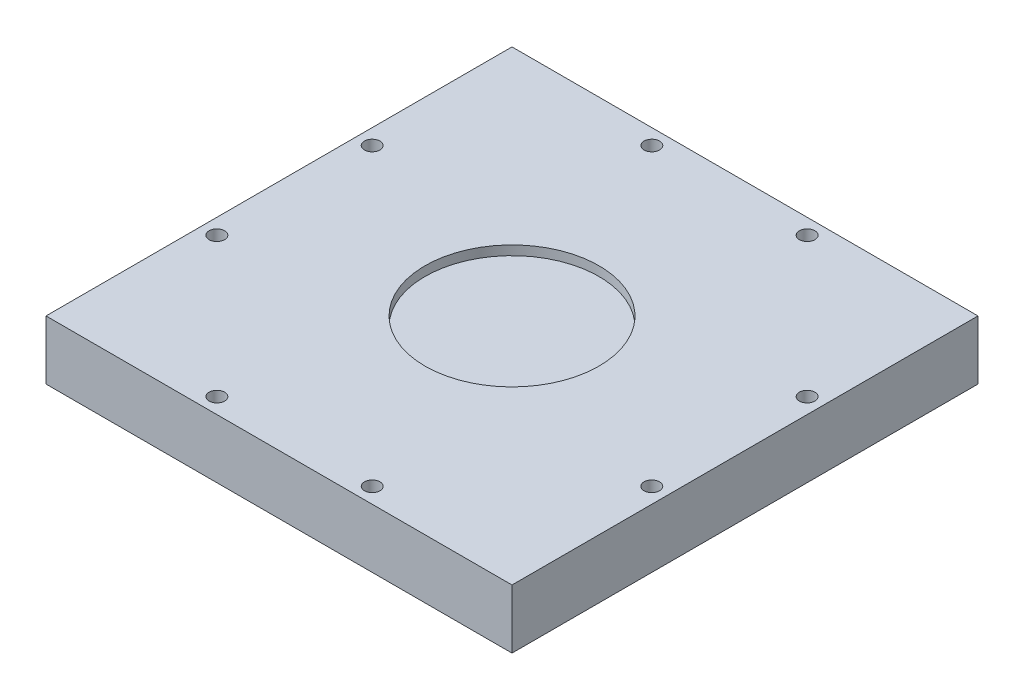
ISO-10303-21;
HEADER;
FILE_DESCRIPTION(('STEP AP214'),'2;1');
FILE_NAME('part.step','',(''),(''),'','','');
FILE_SCHEMA(('AUTOMOTIVE_DESIGN { 1 0 10303 214 1 1 1 1 }'));
ENDSEC;
DATA;
#1=APPLICATION_CONTEXT('core data for automotive mechanical design processes');
#2=APPLICATION_PROTOCOL_DEFINITION('international standard','automotive_design',2000,#1);
#3=PRODUCT_CONTEXT('',#1,'mechanical');
#4=PRODUCT('Part','Part','',(#3));
#5=PRODUCT_RELATED_PRODUCT_CATEGORY('part','',(#4));
#6=PRODUCT_DEFINITION_FORMATION('','',#4);
#7=PRODUCT_DEFINITION_CONTEXT('part definition',#1,'design');
#8=PRODUCT_DEFINITION('design','',#6,#7);
#9=PRODUCT_DEFINITION_SHAPE('','',#8);
#10=(LENGTH_UNIT() NAMED_UNIT(*) SI_UNIT(.MILLI.,.METRE.));
#11=(NAMED_UNIT(*) PLANE_ANGLE_UNIT() SI_UNIT($,.RADIAN.));
#12=(NAMED_UNIT(*) SI_UNIT($,.STERADIAN.) SOLID_ANGLE_UNIT());
#13=UNCERTAINTY_MEASURE_WITH_UNIT(LENGTH_MEASURE(1.E-05),#10,'distance_accuracy_value','');
#14=(GEOMETRIC_REPRESENTATION_CONTEXT(3) GLOBAL_UNCERTAINTY_ASSIGNED_CONTEXT((#13)) GLOBAL_UNIT_ASSIGNED_CONTEXT((#10,
#11,#12)) REPRESENTATION_CONTEXT('',''));
#15=CARTESIAN_POINT('',(0.,0.,0.));
#16=DIRECTION('',(0.,0.,1.));
#17=DIRECTION('',(1.,0.,0.));
#18=AXIS2_PLACEMENT_3D('',#15,#16,#17);
#19=CARTESIAN_POINT('',(0.,19.,0.));
#20=DIRECTION('',(1.,0.,0.));
#21=DIRECTION('',(0.,0.,-1.));
#22=AXIS2_PLACEMENT_3D('',#19,#20,#21);
#23=PLANE('',#22);
#24=DIRECTION('',(0.,0.,1.));
#25=VECTOR('',#24,1.);
#26=CARTESIAN_POINT('',(0.,0.,0.));
#27=LINE('',#26,#25);
#28=CARTESIAN_POINT('',(0.,0.,-150.));
#29=VERTEX_POINT('',#28);
#30=CARTESIAN_POINT('',(0.,0.,0.));
#31=VERTEX_POINT('',#30);
#32=EDGE_CURVE('E106',#29,#31,#27,.T.);
#33=ORIENTED_EDGE('',*,*,#32,.T.);
#34=DIRECTION('',(0.,-1.,0.));
#35=VECTOR('',#34,1.);
#36=CARTESIAN_POINT('',(0.,19.,0.));
#37=LINE('',#36,#35);
#38=CARTESIAN_POINT('',(0.,19.,0.));
#39=VERTEX_POINT('',#38);
#40=EDGE_CURVE('E11',#39,#31,#37,.T.);
#41=ORIENTED_EDGE('',*,*,#40,.F.);
#42=DIRECTION('',(0.,0.,1.));
#43=VECTOR('',#42,1.);
#44=CARTESIAN_POINT('',(0.,19.,0.));
#45=LINE('',#44,#43);
#46=CARTESIAN_POINT('',(0.,19.,-150.));
#47=VERTEX_POINT('',#46);
#48=EDGE_CURVE('E90',#47,#39,#45,.T.);
#49=ORIENTED_EDGE('',*,*,#48,.F.);
#50=DIRECTION('',(0.,-1.,0.));
#51=VECTOR('',#50,1.);
#52=CARTESIAN_POINT('',(0.,19.,-150.));
#53=LINE('',#52,#51);
#54=EDGE_CURVE('E102',#47,#29,#53,.T.);
#55=ORIENTED_EDGE('',*,*,#54,.T.);
#56=EDGE_LOOP('',(#33,#41,#49,#55));
#57=FACE_BOUND('',#56,.T.);
#58=ADVANCED_FACE('F38',(#57),#23,.F.);
#59=CARTESIAN_POINT('',(0.,19.,0.));
#60=DIRECTION('',(0.,0.,-1.));
#61=DIRECTION('',(-1.,0.,0.));
#62=AXIS2_PLACEMENT_3D('',#59,#60,#61);
#63=PLANE('',#62);
#64=DIRECTION('',(1.,0.,0.));
#65=VECTOR('',#64,1.);
#66=CARTESIAN_POINT('',(0.,0.,0.));
#67=LINE('',#66,#65);
#68=CARTESIAN_POINT('',(150.,0.,0.));
#69=VERTEX_POINT('',#68);
#70=EDGE_CURVE('E95',#31,#69,#67,.T.);
#71=ORIENTED_EDGE('',*,*,#70,.T.);
#72=DIRECTION('',(0.,-1.,0.));
#73=VECTOR('',#72,1.);
#74=CARTESIAN_POINT('',(150.,19.,0.));
#75=LINE('',#74,#73);
#76=CARTESIAN_POINT('',(150.,19.,0.));
#77=VERTEX_POINT('',#76);
#78=EDGE_CURVE('E47',#77,#69,#75,.T.);
#79=ORIENTED_EDGE('',*,*,#78,.F.);
#80=DIRECTION('',(1.,0.,0.));
#81=VECTOR('',#80,1.);
#82=CARTESIAN_POINT('',(0.,19.,0.));
#83=LINE('',#82,#81);
#84=EDGE_CURVE('E85',#39,#77,#83,.T.);
#85=ORIENTED_EDGE('',*,*,#84,.F.);
#86=ORIENTED_EDGE('',*,*,#40,.T.);
#87=EDGE_LOOP('',(#71,#79,#85,#86));
#88=FACE_BOUND('',#87,.T.);
#89=ADVANCED_FACE('F94',(#88),#63,.F.);
#90=CARTESIAN_POINT('',(150.,19.,0.));
#91=DIRECTION('',(-1.,0.,0.));
#92=DIRECTION('',(0.,0.,1.));
#93=AXIS2_PLACEMENT_3D('',#90,#91,#92);
#94=PLANE('',#93);
#95=DIRECTION('',(0.,0.,-1.));
#96=VECTOR('',#95,1.);
#97=CARTESIAN_POINT('',(150.,0.,0.));
#98=LINE('',#97,#96);
#99=CARTESIAN_POINT('',(150.,0.,-150.));
#100=VERTEX_POINT('',#99);
#101=EDGE_CURVE('E72',#69,#100,#98,.T.);
#102=ORIENTED_EDGE('',*,*,#101,.T.);
#103=DIRECTION('',(0.,-1.,0.));
#104=VECTOR('',#103,1.);
#105=CARTESIAN_POINT('',(150.,19.,-150.));
#106=LINE('',#105,#104);
#107=CARTESIAN_POINT('',(150.,19.,-150.));
#108=VERTEX_POINT('',#107);
#109=EDGE_CURVE('E97',#108,#100,#106,.T.);
#110=ORIENTED_EDGE('',*,*,#109,.F.);
#111=DIRECTION('',(0.,0.,-1.));
#112=VECTOR('',#111,1.);
#113=CARTESIAN_POINT('',(150.,19.,0.));
#114=LINE('',#113,#112);
#115=EDGE_CURVE('E88',#77,#108,#114,.T.);
#116=ORIENTED_EDGE('',*,*,#115,.F.);
#117=ORIENTED_EDGE('',*,*,#78,.T.);
#118=EDGE_LOOP('',(#102,#110,#116,#117));
#119=FACE_BOUND('',#118,.T.);
#120=ADVANCED_FACE('F98',(#119),#94,.F.);
#121=CARTESIAN_POINT('',(0.,19.,-150.));
#122=DIRECTION('',(0.,0.,1.));
#123=DIRECTION('',(1.,0.,0.));
#124=AXIS2_PLACEMENT_3D('',#121,#122,#123);
#125=PLANE('',#124);
#126=DIRECTION('',(-1.,0.,0.));
#127=VECTOR('',#126,1.);
#128=CARTESIAN_POINT('',(0.,0.,-150.));
#129=LINE('',#128,#127);
#130=EDGE_CURVE('E78',#100,#29,#129,.T.);
#131=ORIENTED_EDGE('',*,*,#130,.T.);
#132=ORIENTED_EDGE('',*,*,#54,.F.);
#133=DIRECTION('',(-1.,0.,0.));
#134=VECTOR('',#133,1.);
#135=CARTESIAN_POINT('',(0.,19.,-150.));
#136=LINE('',#135,#134);
#137=EDGE_CURVE('E55',#108,#47,#136,.T.);
#138=ORIENTED_EDGE('',*,*,#137,.F.);
#139=ORIENTED_EDGE('',*,*,#109,.T.);
#140=EDGE_LOOP('',(#131,#132,#138,#139));
#141=FACE_BOUND('',#140,.T.);
#142=ADVANCED_FACE('F120',(#141),#125,.F.);
#143=CARTESIAN_POINT('',(0.,19.,0.));
#144=DIRECTION('',(0.,-1.,0.));
#145=DIRECTION('',(0.,0.,-1.));
#146=AXIS2_PLACEMENT_3D('',#143,#144,#145);
#147=PLANE('',#146);
#148=CARTESIAN_POINT('',(5.00000000000024,19.,-49.9999999999993));
#149=DIRECTION('',(0.,1.,0.));
#150=DIRECTION('',(-1.,0.,0.));
#151=AXIS2_PLACEMENT_3D('',#148,#149,#150);
#152=CIRCLE('',#151,2.49999999999999);
#153=CARTESIAN_POINT('',(2.50000000000025,19.,-49.9999999999993));
#154=VERTEX_POINT('',#153);
#155=EDGE_CURVE('E159',#154,#154,#152,.T.);
#156=ORIENTED_EDGE('',*,*,#155,.F.);
#157=EDGE_LOOP('',(#156));
#158=FACE_BOUND('',#157,.T.);
#159=CARTESIAN_POINT('',(4.99999999999972,19.,-99.9999999999993));
#160=DIRECTION('',(0.,1.,0.));
#161=DIRECTION('',(-1.,0.,0.));
#162=AXIS2_PLACEMENT_3D('',#159,#160,#161);
#163=CIRCLE('',#162,2.5);
#164=CARTESIAN_POINT('',(2.49999999999972,19.,-99.9999999999992));
#165=VERTEX_POINT('',#164);
#166=EDGE_CURVE('E167',#165,#165,#163,.T.);
#167=ORIENTED_EDGE('',*,*,#166,.F.);
#168=EDGE_LOOP('',(#167));
#169=FACE_BOUND('',#168,.T.);
#170=CARTESIAN_POINT('',(50.,19.,-145.));
#171=DIRECTION('',(0.,1.,0.));
#172=DIRECTION('',(0.,0.,-1.));
#173=AXIS2_PLACEMENT_3D('',#170,#171,#172);
#174=CIRCLE('',#173,2.49999999999999);
#175=CARTESIAN_POINT('',(50.,19.,-147.5));
#176=VERTEX_POINT('',#175);
#177=EDGE_CURVE('E175',#176,#176,#174,.T.);
#178=ORIENTED_EDGE('',*,*,#177,.F.);
#179=EDGE_LOOP('',(#178));
#180=FACE_BOUND('',#179,.T.);
#181=CARTESIAN_POINT('',(100.,19.,-145.));
#182=DIRECTION('',(0.,1.,0.));
#183=DIRECTION('',(0.,0.,-1.));
#184=AXIS2_PLACEMENT_3D('',#181,#182,#183);
#185=CIRCLE('',#184,2.5);
#186=CARTESIAN_POINT('',(100.,19.,-147.5));
#187=VERTEX_POINT('',#186);
#188=EDGE_CURVE('E183',#187,#187,#185,.T.);
#189=ORIENTED_EDGE('',*,*,#188,.F.);
#190=EDGE_LOOP('',(#189));
#191=FACE_BOUND('',#190,.T.);
#192=CARTESIAN_POINT('',(145.,19.,-100.));
#193=DIRECTION('',(0.,1.,0.));
#194=DIRECTION('',(1.,0.,0.));
#195=AXIS2_PLACEMENT_3D('',#192,#193,#194);
#196=CIRCLE('',#195,2.49999999999999);
#197=CARTESIAN_POINT('',(147.5,19.,-100.));
#198=VERTEX_POINT('',#197);
#199=EDGE_CURVE('E191',#198,#198,#196,.T.);
#200=ORIENTED_EDGE('',*,*,#199,.F.);
#201=EDGE_LOOP('',(#200));
#202=FACE_BOUND('',#201,.T.);
#203=CARTESIAN_POINT('',(145.,19.,-50.0000000000003));
#204=DIRECTION('',(0.,1.,0.));
#205=DIRECTION('',(1.,0.,0.));
#206=AXIS2_PLACEMENT_3D('',#203,#204,#205);
#207=CIRCLE('',#206,2.5);
#208=CARTESIAN_POINT('',(147.5,19.,-50.0000000000003));
#209=VERTEX_POINT('',#208);
#210=EDGE_CURVE('E151',#209,#209,#207,.T.);
#211=ORIENTED_EDGE('',*,*,#210,.F.);
#212=EDGE_LOOP('',(#211));
#213=FACE_BOUND('',#212,.T.);
#214=CARTESIAN_POINT('',(50.,19.,-5.));
#215=DIRECTION('',(0.,1.,0.));
#216=DIRECTION('',(0.,0.,1.));
#217=AXIS2_PLACEMENT_3D('',#214,#215,#216);
#218=CIRCLE('',#217,2.5);
#219=CARTESIAN_POINT('',(50.,19.,-2.5));
#220=VERTEX_POINT('',#219);
#221=EDGE_CURVE('E144',#220,#220,#218,.T.);
#222=ORIENTED_EDGE('',*,*,#221,.F.);
#223=EDGE_LOOP('',(#222));
#224=FACE_BOUND('',#223,.T.);
#225=CARTESIAN_POINT('',(100.,19.,-5.));
#226=DIRECTION('',(0.,1.,0.));
#227=DIRECTION('',(0.,0.,1.));
#228=AXIS2_PLACEMENT_3D('',#225,#226,#227);
#229=CIRCLE('',#228,2.49999999999999);
#230=CARTESIAN_POINT('',(100.,19.,-2.50000000000001));
#231=VERTEX_POINT('',#230);
#232=EDGE_CURVE('E135',#231,#231,#229,.T.);
#233=ORIENTED_EDGE('',*,*,#232,.F.);
#234=EDGE_LOOP('',(#233));
#235=FACE_BOUND('',#234,.T.);
#236=CARTESIAN_POINT('',(75.,19.,-75.));
#237=DIRECTION('',(0.,1.,0.));
#238=DIRECTION('',(0.,0.,1.));
#239=AXIS2_PLACEMENT_3D('',#236,#237,#238);
#240=CIRCLE('',#239,28.);
#241=CARTESIAN_POINT('',(75.,19.,-47.));
#242=VERTEX_POINT('',#241);
#243=EDGE_CURVE('E127',#242,#242,#240,.T.);
#244=ORIENTED_EDGE('',*,*,#243,.F.);
#245=EDGE_LOOP('',(#244));
#246=FACE_BOUND('',#245,.T.);
#247=ORIENTED_EDGE('',*,*,#48,.T.);
#248=ORIENTED_EDGE('',*,*,#84,.T.);
#249=ORIENTED_EDGE('',*,*,#115,.T.);
#250=ORIENTED_EDGE('',*,*,#137,.T.);
#251=EDGE_LOOP('',(#247,#248,#249,#250));
#252=FACE_BOUND('',#251,.T.);
#253=ADVANCED_FACE('F86',(#158,#169,#180,#191,#202,#213,#224,#235,#246,#252),#147,.F.);
#254=CARTESIAN_POINT('',(0.,0.,0.));
#255=DIRECTION('',(0.,-1.,0.));
#256=DIRECTION('',(0.,0.,-1.));
#257=AXIS2_PLACEMENT_3D('',#254,#255,#256);
#258=PLANE('',#257);
#259=ORIENTED_EDGE('',*,*,#32,.F.);
#260=ORIENTED_EDGE('',*,*,#130,.F.);
#261=ORIENTED_EDGE('',*,*,#101,.F.);
#262=ORIENTED_EDGE('',*,*,#70,.F.);
#263=EDGE_LOOP('',(#259,#260,#261,#262));
#264=FACE_BOUND('',#263,.T.);
#265=ADVANCED_FACE('F123',(#264),#258,.T.);
#266=CARTESIAN_POINT('',(75.,16.,-75.));
#267=DIRECTION('',(0.,1.,0.));
#268=DIRECTION('',(0.,0.,1.));
#269=AXIS2_PLACEMENT_3D('',#266,#267,#268);
#270=CYLINDRICAL_SURFACE('',#269,28.);
#271=CARTESIAN_POINT('',(75.,16.,-75.));
#272=DIRECTION('',(0.,1.,0.));
#273=DIRECTION('',(0.,0.,1.));
#274=AXIS2_PLACEMENT_3D('',#271,#272,#273);
#275=CIRCLE('',#274,28.);
#276=CARTESIAN_POINT('',(75.,16.,-47.));
#277=VERTEX_POINT('',#276);
#278=EDGE_CURVE('E110',#277,#277,#275,.T.);
#279=ORIENTED_EDGE('',*,*,#278,.F.);
#280=EDGE_LOOP('',(#279));
#281=FACE_BOUND('',#280,.T.);
#282=ORIENTED_EDGE('',*,*,#243,.T.);
#283=EDGE_LOOP('',(#282));
#284=FACE_BOUND('',#283,.T.);
#285=ADVANCED_FACE('F220',(#281,#284),#270,.F.);
#286=CARTESIAN_POINT('',(75.,16.,-75.));
#287=DIRECTION('',(0.,1.,0.));
#288=DIRECTION('',(0.,0.,1.));
#289=AXIS2_PLACEMENT_3D('',#286,#287,#288);
#290=PLANE('',#289);
#291=ORIENTED_EDGE('',*,*,#278,.T.);
#292=EDGE_LOOP('',(#291));
#293=FACE_BOUND('',#292,.T.);
#294=ADVANCED_FACE('F222',(#293),#290,.T.);
#295=CARTESIAN_POINT('',(100.,14.,-5.));
#296=DIRECTION('',(0.,1.,0.));
#297=DIRECTION('',(0.,0.,1.));
#298=AXIS2_PLACEMENT_3D('',#295,#296,#297);
#299=CYLINDRICAL_SURFACE('',#298,2.49999999999999);
#300=CARTESIAN_POINT('',(100.,14.,-5.));
#301=DIRECTION('',(0.,1.,0.));
#302=DIRECTION('',(0.,0.,1.));
#303=AXIS2_PLACEMENT_3D('',#300,#301,#302);
#304=CIRCLE('',#303,2.49999999999999);
#305=CARTESIAN_POINT('',(100.,14.,-2.50000000000001));
#306=VERTEX_POINT('',#305);
#307=EDGE_CURVE('E139',#306,#306,#304,.T.);
#308=ORIENTED_EDGE('',*,*,#307,.F.);
#309=EDGE_LOOP('',(#308));
#310=FACE_BOUND('',#309,.T.);
#311=ORIENTED_EDGE('',*,*,#232,.T.);
#312=EDGE_LOOP('',(#311));
#313=FACE_BOUND('',#312,.T.);
#314=ADVANCED_FACE('F229',(#310,#313),#299,.F.);
#315=CARTESIAN_POINT('',(100.,14.,-5.));
#316=DIRECTION('',(0.,1.,0.));
#317=DIRECTION('',(0.,0.,1.));
#318=AXIS2_PLACEMENT_3D('',#315,#316,#317);
#319=PLANE('',#318);
#320=ORIENTED_EDGE('',*,*,#307,.T.);
#321=EDGE_LOOP('',(#320));
#322=FACE_BOUND('',#321,.T.);
#323=ADVANCED_FACE('F279',(#322),#319,.T.);
#324=CARTESIAN_POINT('',(50.,14.,-5.));
#325=DIRECTION('',(0.,1.,0.));
#326=DIRECTION('',(0.,0.,1.));
#327=AXIS2_PLACEMENT_3D('',#324,#325,#326);
#328=CYLINDRICAL_SURFACE('',#327,2.5);
#329=CARTESIAN_POINT('',(50.,14.,-5.));
#330=DIRECTION('',(0.,1.,0.));
#331=DIRECTION('',(0.,0.,1.));
#332=AXIS2_PLACEMENT_3D('',#329,#330,#331);
#333=CIRCLE('',#332,2.5);
#334=CARTESIAN_POINT('',(50.,14.,-2.5));
#335=VERTEX_POINT('',#334);
#336=EDGE_CURVE('E131',#335,#335,#333,.T.);
#337=ORIENTED_EDGE('',*,*,#336,.F.);
#338=EDGE_LOOP('',(#337));
#339=FACE_BOUND('',#338,.T.);
#340=ORIENTED_EDGE('',*,*,#221,.T.);
#341=EDGE_LOOP('',(#340));
#342=FACE_BOUND('',#341,.T.);
#343=ADVANCED_FACE('F289',(#339,#342),#328,.F.);
#344=CARTESIAN_POINT('',(50.,14.,-5.));
#345=DIRECTION('',(0.,1.,0.));
#346=DIRECTION('',(0.,0.,1.));
#347=AXIS2_PLACEMENT_3D('',#344,#345,#346);
#348=PLANE('',#347);
#349=ORIENTED_EDGE('',*,*,#336,.T.);
#350=EDGE_LOOP('',(#349));
#351=FACE_BOUND('',#350,.T.);
#352=ADVANCED_FACE('F298',(#351),#348,.T.);
#353=CARTESIAN_POINT('',(145.,14.,-50.0000000000003));
#354=DIRECTION('',(0.,1.,0.));
#355=DIRECTION('',(0.,0.,1.));
#356=AXIS2_PLACEMENT_3D('',#353,#354,#355);
#357=CYLINDRICAL_SURFACE('',#356,2.5);
#358=CARTESIAN_POINT('',(145.,14.,-50.0000000000003));
#359=DIRECTION('',(0.,1.,0.));
#360=DIRECTION('',(1.,0.,0.));
#361=AXIS2_PLACEMENT_3D('',#358,#359,#360);
#362=CIRCLE('',#361,2.5);
#363=CARTESIAN_POINT('',(147.5,14.,-50.0000000000003));
#364=VERTEX_POINT('',#363);
#365=EDGE_CURVE('E140',#364,#364,#362,.T.);
#366=ORIENTED_EDGE('',*,*,#365,.F.);
#367=EDGE_LOOP('',(#366));
#368=FACE_BOUND('',#367,.T.);
#369=ORIENTED_EDGE('',*,*,#210,.T.);
#370=EDGE_LOOP('',(#369));
#371=FACE_BOUND('',#370,.T.);
#372=ADVANCED_FACE('F307',(#368,#371),#357,.F.);
#373=CARTESIAN_POINT('',(145.,14.,-50.0000000000003));
#374=DIRECTION('',(0.,1.,0.));
#375=DIRECTION('',(1.,0.,0.));
#376=AXIS2_PLACEMENT_3D('',#373,#374,#375);
#377=PLANE('',#376);
#378=ORIENTED_EDGE('',*,*,#365,.T.);
#379=EDGE_LOOP('',(#378));
#380=FACE_BOUND('',#379,.T.);
#381=ADVANCED_FACE('F204',(#380),#377,.T.);
#382=CARTESIAN_POINT('',(145.,14.,-100.));
#383=DIRECTION('',(0.,1.,0.));
#384=DIRECTION('',(0.,0.,1.));
#385=AXIS2_PLACEMENT_3D('',#382,#383,#384);
#386=CYLINDRICAL_SURFACE('',#385,2.49999999999999);
#387=CARTESIAN_POINT('',(145.,14.,-100.));
#388=DIRECTION('',(0.,1.,0.));
#389=DIRECTION('',(1.,0.,0.));
#390=AXIS2_PLACEMENT_3D('',#387,#388,#389);
#391=CIRCLE('',#390,2.49999999999999);
#392=CARTESIAN_POINT('',(147.5,14.,-100.));
#393=VERTEX_POINT('',#392);
#394=EDGE_CURVE('E155',#393,#393,#391,.T.);
#395=ORIENTED_EDGE('',*,*,#394,.F.);
#396=EDGE_LOOP('',(#395));
#397=FACE_BOUND('',#396,.T.);
#398=ORIENTED_EDGE('',*,*,#199,.T.);
#399=EDGE_LOOP('',(#398));
#400=FACE_BOUND('',#399,.T.);
#401=ADVANCED_FACE('F201',(#397,#400),#386,.F.);
#402=CARTESIAN_POINT('',(145.,14.,-100.));
#403=DIRECTION('',(0.,1.,0.));
#404=DIRECTION('',(1.,0.,0.));
#405=AXIS2_PLACEMENT_3D('',#402,#403,#404);
#406=PLANE('',#405);
#407=ORIENTED_EDGE('',*,*,#394,.T.);
#408=EDGE_LOOP('',(#407));
#409=FACE_BOUND('',#408,.T.);
#410=ADVANCED_FACE('F199',(#409),#406,.T.);
#411=CARTESIAN_POINT('',(100.,14.,-145.));
#412=DIRECTION('',(0.,1.,0.));
#413=DIRECTION('',(0.,0.,1.));
#414=AXIS2_PLACEMENT_3D('',#411,#412,#413);
#415=CYLINDRICAL_SURFACE('',#414,2.5);
#416=CARTESIAN_POINT('',(100.,14.,-145.));
#417=DIRECTION('',(0.,1.,0.));
#418=DIRECTION('',(0.,0.,-1.));
#419=AXIS2_PLACEMENT_3D('',#416,#417,#418);
#420=CIRCLE('',#419,2.5);
#421=CARTESIAN_POINT('',(100.,14.,-147.5));
#422=VERTEX_POINT('',#421);
#423=EDGE_CURVE('E187',#422,#422,#420,.T.);
#424=ORIENTED_EDGE('',*,*,#423,.F.);
#425=EDGE_LOOP('',(#424));
#426=FACE_BOUND('',#425,.T.);
#427=ORIENTED_EDGE('',*,*,#188,.T.);
#428=EDGE_LOOP('',(#427));
#429=FACE_BOUND('',#428,.T.);
#430=ADVANCED_FACE('F334',(#426,#429),#415,.F.);
#431=CARTESIAN_POINT('',(100.,14.,-145.));
#432=DIRECTION('',(0.,1.,0.));
#433=DIRECTION('',(0.,0.,-1.));
#434=AXIS2_PLACEMENT_3D('',#431,#432,#433);
#435=PLANE('',#434);
#436=ORIENTED_EDGE('',*,*,#423,.T.);
#437=EDGE_LOOP('',(#436));
#438=FACE_BOUND('',#437,.T.);
#439=ADVANCED_FACE('F341',(#438),#435,.T.);
#440=CARTESIAN_POINT('',(50.,14.,-145.));
#441=DIRECTION('',(0.,1.,0.));
#442=DIRECTION('',(0.,0.,1.));
#443=AXIS2_PLACEMENT_3D('',#440,#441,#442);
#444=CYLINDRICAL_SURFACE('',#443,2.49999999999999);
#445=CARTESIAN_POINT('',(50.,14.,-145.));
#446=DIRECTION('',(0.,1.,0.));
#447=DIRECTION('',(0.,0.,-1.));
#448=AXIS2_PLACEMENT_3D('',#445,#446,#447);
#449=CIRCLE('',#448,2.49999999999999);
#450=CARTESIAN_POINT('',(50.,14.,-147.5));
#451=VERTEX_POINT('',#450);
#452=EDGE_CURVE('E179',#451,#451,#449,.T.);
#453=ORIENTED_EDGE('',*,*,#452,.F.);
#454=EDGE_LOOP('',(#453));
#455=FACE_BOUND('',#454,.T.);
#456=ORIENTED_EDGE('',*,*,#177,.T.);
#457=EDGE_LOOP('',(#456));
#458=FACE_BOUND('',#457,.T.);
#459=ADVANCED_FACE('F349',(#455,#458),#444,.F.);
#460=CARTESIAN_POINT('',(50.,14.,-145.));
#461=DIRECTION('',(0.,1.,0.));
#462=DIRECTION('',(0.,0.,-1.));
#463=AXIS2_PLACEMENT_3D('',#460,#461,#462);
#464=PLANE('',#463);
#465=ORIENTED_EDGE('',*,*,#452,.T.);
#466=EDGE_LOOP('',(#465));
#467=FACE_BOUND('',#466,.T.);
#468=ADVANCED_FACE('F357',(#467),#464,.T.);
#469=CARTESIAN_POINT('',(4.99999999999972,14.,-99.9999999999993));
#470=DIRECTION('',(0.,1.,0.));
#471=DIRECTION('',(0.,0.,1.));
#472=AXIS2_PLACEMENT_3D('',#469,#470,#471);
#473=CYLINDRICAL_SURFACE('',#472,2.5);
#474=CARTESIAN_POINT('',(4.99999999999972,14.,-99.9999999999993));
#475=DIRECTION('',(0.,1.,0.));
#476=DIRECTION('',(-1.,0.,0.));
#477=AXIS2_PLACEMENT_3D('',#474,#475,#476);
#478=CIRCLE('',#477,2.5);
#479=CARTESIAN_POINT('',(2.49999999999972,14.,-99.9999999999992));
#480=VERTEX_POINT('',#479);
#481=EDGE_CURVE('E171',#480,#480,#478,.T.);
#482=ORIENTED_EDGE('',*,*,#481,.F.);
#483=EDGE_LOOP('',(#482));
#484=FACE_BOUND('',#483,.T.);
#485=ORIENTED_EDGE('',*,*,#166,.T.);
#486=EDGE_LOOP('',(#485));
#487=FACE_BOUND('',#486,.T.);
#488=ADVANCED_FACE('F365',(#484,#487),#473,.F.);
#489=CARTESIAN_POINT('',(4.99999999999972,14.,-99.9999999999993));
#490=DIRECTION('',(0.,1.,0.));
#491=DIRECTION('',(-1.,0.,0.));
#492=AXIS2_PLACEMENT_3D('',#489,#490,#491);
#493=PLANE('',#492);
#494=ORIENTED_EDGE('',*,*,#481,.T.);
#495=EDGE_LOOP('',(#494));
#496=FACE_BOUND('',#495,.T.);
#497=ADVANCED_FACE('F373',(#496),#493,.T.);
#498=CARTESIAN_POINT('',(5.00000000000024,14.,-49.9999999999993));
#499=DIRECTION('',(0.,1.,0.));
#500=DIRECTION('',(0.,0.,1.));
#501=AXIS2_PLACEMENT_3D('',#498,#499,#500);
#502=CYLINDRICAL_SURFACE('',#501,2.49999999999999);
#503=CARTESIAN_POINT('',(5.00000000000024,14.,-49.9999999999993));
#504=DIRECTION('',(0.,1.,0.));
#505=DIRECTION('',(-1.,0.,0.));
#506=AXIS2_PLACEMENT_3D('',#503,#504,#505);
#507=CIRCLE('',#506,2.49999999999999);
#508=CARTESIAN_POINT('',(2.50000000000025,14.,-49.9999999999993));
#509=VERTEX_POINT('',#508);
#510=EDGE_CURVE('E163',#509,#509,#507,.T.);
#511=ORIENTED_EDGE('',*,*,#510,.F.);
#512=EDGE_LOOP('',(#511));
#513=FACE_BOUND('',#512,.T.);
#514=ORIENTED_EDGE('',*,*,#155,.T.);
#515=EDGE_LOOP('',(#514));
#516=FACE_BOUND('',#515,.T.);
#517=ADVANCED_FACE('F381',(#513,#516),#502,.F.);
#518=CARTESIAN_POINT('',(5.00000000000024,14.,-49.9999999999993));
#519=DIRECTION('',(0.,1.,0.));
#520=DIRECTION('',(-1.,0.,0.));
#521=AXIS2_PLACEMENT_3D('',#518,#519,#520);
#522=PLANE('',#521);
#523=ORIENTED_EDGE('',*,*,#510,.T.);
#524=EDGE_LOOP('',(#523));
#525=FACE_BOUND('',#524,.T.);
#526=ADVANCED_FACE('F389',(#525),#522,.T.);
#527=CLOSED_SHELL('',(#58,#89,#120,#142,#253,#265,#285,#294,#314,#323,#343,#352,#372,#381,#401,
#410,#430,#439,#459,#468,#488,#497,#517,#526));
#528=MANIFOLD_SOLID_BREP('B2',#527);
#529=ADVANCED_BREP_SHAPE_REPRESENTATION('',(#18,#528),#14);
#530=SHAPE_DEFINITION_REPRESENTATION(#9,#529);
ENDSEC;
END-ISO-10303-21;
